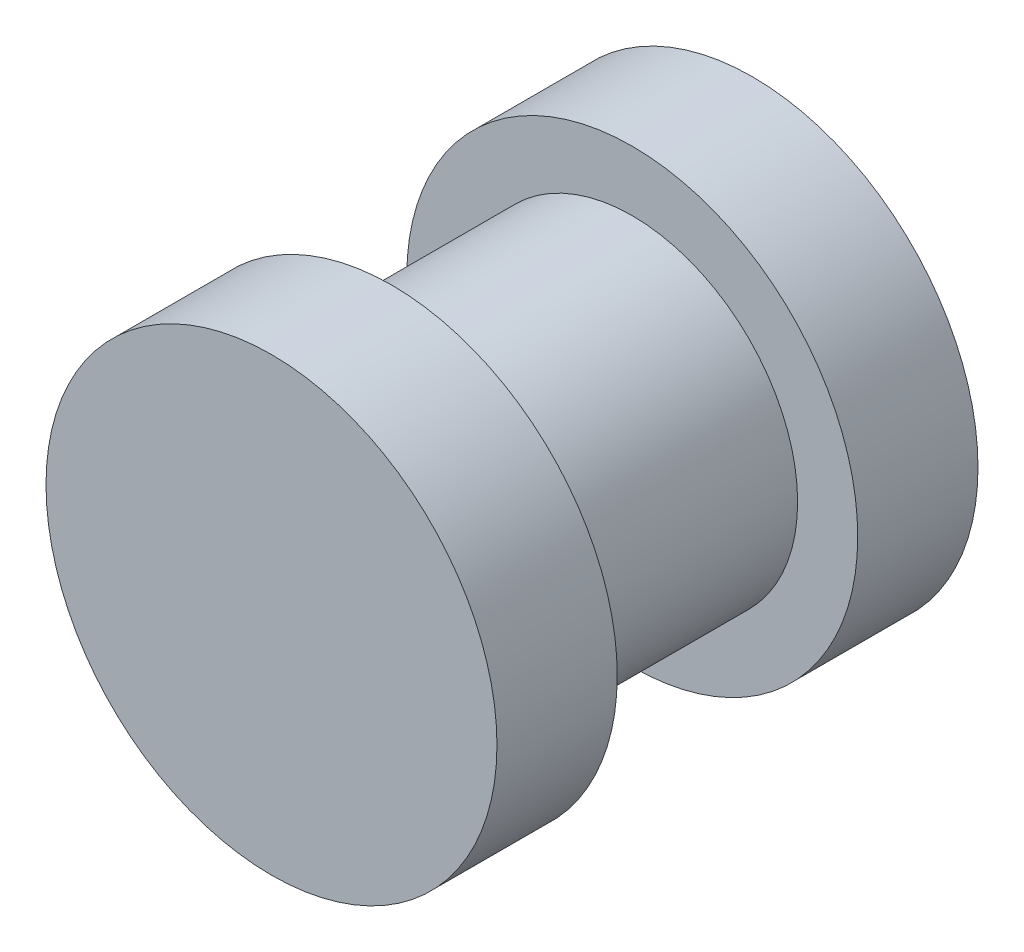
ISO-10303-21;
HEADER;
FILE_DESCRIPTION(('STEP AP214'),'2;1');
FILE_NAME('part.step','',(''),(''),'','','');
FILE_SCHEMA(('AUTOMOTIVE_DESIGN { 1 0 10303 214 1 1 1 1 }'));
ENDSEC;
DATA;
#1=APPLICATION_CONTEXT('core data for automotive mechanical design processes');
#2=APPLICATION_PROTOCOL_DEFINITION('international standard','automotive_design',2000,#1);
#3=PRODUCT_CONTEXT('',#1,'mechanical');
#4=PRODUCT('Part','Part','',(#3));
#5=PRODUCT_RELATED_PRODUCT_CATEGORY('part','',(#4));
#6=PRODUCT_DEFINITION_FORMATION('','',#4);
#7=PRODUCT_DEFINITION_CONTEXT('part definition',#1,'design');
#8=PRODUCT_DEFINITION('design','',#6,#7);
#9=PRODUCT_DEFINITION_SHAPE('','',#8);
#10=(LENGTH_UNIT() NAMED_UNIT(*) SI_UNIT(.MILLI.,.METRE.));
#11=(NAMED_UNIT(*) PLANE_ANGLE_UNIT() SI_UNIT($,.RADIAN.));
#12=(NAMED_UNIT(*) SI_UNIT($,.STERADIAN.) SOLID_ANGLE_UNIT());
#13=UNCERTAINTY_MEASURE_WITH_UNIT(LENGTH_MEASURE(1.E-05),#10,'distance_accuracy_value','');
#14=(GEOMETRIC_REPRESENTATION_CONTEXT(3) GLOBAL_UNCERTAINTY_ASSIGNED_CONTEXT((#13)) GLOBAL_UNIT_ASSIGNED_CONTEXT((#10,
#11,#12)) REPRESENTATION_CONTEXT('',''));
#15=CARTESIAN_POINT('',(0.,0.,0.));
#16=DIRECTION('',(0.,0.,1.));
#17=DIRECTION('',(1.,0.,0.));
#18=AXIS2_PLACEMENT_3D('',#15,#16,#17);
#19=CARTESIAN_POINT('',(0.,0.,5.08));
#20=DIRECTION('',(0.,0.,-1.));
#21=DIRECTION('',(-1.,0.,0.));
#22=AXIS2_PLACEMENT_3D('',#19,#20,#21);
#23=CYLINDRICAL_SURFACE('',#22,4.7625);
#24=CARTESIAN_POINT('',(0.,0.,-5.08));
#25=DIRECTION('',(0.,0.,1.));
#26=DIRECTION('',(1.,0.,0.));
#27=AXIS2_PLACEMENT_3D('',#24,#25,#26);
#28=CIRCLE('',#27,4.7625);
#29=CARTESIAN_POINT('',(4.7625,0.,-5.08));
#30=VERTEX_POINT('',#29);
#31=EDGE_CURVE('E41',#30,#30,#28,.T.);
#32=ORIENTED_EDGE('',*,*,#31,.T.);
#33=EDGE_LOOP('',(#32));
#34=FACE_BOUND('',#33,.T.);
#35=CARTESIAN_POINT('',(0.,0.,-2.54));
#36=DIRECTION('',(0.,0.,1.));
#37=DIRECTION('',(1.,0.,0.));
#38=AXIS2_PLACEMENT_3D('',#35,#36,#37);
#39=CIRCLE('',#38,4.7625);
#40=CARTESIAN_POINT('',(4.7625,0.,-2.54));
#41=VERTEX_POINT('',#40);
#42=EDGE_CURVE('E36',#41,#41,#39,.T.);
#43=ORIENTED_EDGE('',*,*,#42,.F.);
#44=EDGE_LOOP('',(#43));
#45=FACE_BOUND('',#44,.T.);
#46=ADVANCED_FACE('F33',(#34,#45),#23,.T.);
#47=CARTESIAN_POINT('',(0.,0.,-5.08));
#48=DIRECTION('',(0.,0.,1.));
#49=DIRECTION('',(1.,0.,0.));
#50=AXIS2_PLACEMENT_3D('',#47,#48,#49);
#51=PLANE('',#50);
#52=DIRECTION('',(1.,0.,0.));
#53=VECTOR('',#52,1.);
#54=CARTESIAN_POINT('',(1.905,2.54,-5.08));
#55=LINE('',#54,#53);
#56=CARTESIAN_POINT('',(-1.905,2.54,-5.08));
#57=VERTEX_POINT('',#56);
#58=CARTESIAN_POINT('',(1.905,2.54,-5.08));
#59=VERTEX_POINT('',#58);
#60=EDGE_CURVE('E84',#57,#59,#55,.T.);
#61=ORIENTED_EDGE('',*,*,#60,.F.);
#62=DIRECTION('',(0.,1.,0.));
#63=VECTOR('',#62,1.);
#64=CARTESIAN_POINT('',(-1.905,-2.54,-5.08));
#65=LINE('',#64,#63);
#66=CARTESIAN_POINT('',(-1.905,-2.54,-5.08));
#67=VERTEX_POINT('',#66);
#68=EDGE_CURVE('E49',#67,#57,#65,.T.);
#69=ORIENTED_EDGE('',*,*,#68,.F.);
#70=DIRECTION('',(-1.,0.,0.));
#71=VECTOR('',#70,1.);
#72=CARTESIAN_POINT('',(1.905,-2.54,-5.08));
#73=LINE('',#72,#71);
#74=CARTESIAN_POINT('',(1.905,-2.54,-5.08));
#75=VERTEX_POINT('',#74);
#76=EDGE_CURVE('E100',#75,#67,#73,.T.);
#77=ORIENTED_EDGE('',*,*,#76,.F.);
#78=DIRECTION('',(0.,-1.,0.));
#79=VECTOR('',#78,1.);
#80=CARTESIAN_POINT('',(1.905,-2.54,-5.08));
#81=LINE('',#80,#79);
#82=EDGE_CURVE('E107',#59,#75,#81,.T.);
#83=ORIENTED_EDGE('',*,*,#82,.F.);
#84=EDGE_LOOP('',(#61,#69,#77,#83));
#85=FACE_BOUND('',#84,.T.);
#86=ORIENTED_EDGE('',*,*,#31,.F.);
#87=EDGE_LOOP('',(#86));
#88=FACE_BOUND('',#87,.T.);
#89=ADVANCED_FACE('F139',(#85,#88),#51,.F.);
#90=CARTESIAN_POINT('',(-1.905,-2.54,-1.27));
#91=DIRECTION('',(-1.,0.,0.));
#92=DIRECTION('',(0.,0.,1.));
#93=AXIS2_PLACEMENT_3D('',#90,#91,#92);
#94=PLANE('',#93);
#95=ORIENTED_EDGE('',*,*,#68,.T.);
#96=DIRECTION('',(0.,0.,-1.));
#97=VECTOR('',#96,1.);
#98=CARTESIAN_POINT('',(-1.905,2.54,-1.27));
#99=LINE('',#98,#97);
#100=CARTESIAN_POINT('',(-1.905,2.54,-1.27));
#101=VERTEX_POINT('',#100);
#102=EDGE_CURVE('E72',#101,#57,#99,.T.);
#103=ORIENTED_EDGE('',*,*,#102,.F.);
#104=DIRECTION('',(0.,1.,0.));
#105=VECTOR('',#104,1.);
#106=CARTESIAN_POINT('',(-1.905,-2.54,-1.27));
#107=LINE('',#106,#105);
#108=CARTESIAN_POINT('',(-1.905,-2.54,-1.27));
#109=VERTEX_POINT('',#108);
#110=EDGE_CURVE('E98',#109,#101,#107,.T.);
#111=ORIENTED_EDGE('',*,*,#110,.F.);
#112=DIRECTION('',(0.,0.,-1.));
#113=VECTOR('',#112,1.);
#114=CARTESIAN_POINT('',(-1.905,-2.54,-1.27));
#115=LINE('',#114,#113);
#116=EDGE_CURVE('E57',#109,#67,#115,.T.);
#117=ORIENTED_EDGE('',*,*,#116,.T.);
#118=EDGE_LOOP('',(#95,#103,#111,#117));
#119=FACE_BOUND('',#118,.T.);
#120=ADVANCED_FACE('F145',(#119),#94,.F.);
#121=CARTESIAN_POINT('',(1.905,-2.54,-1.27));
#122=DIRECTION('',(0.,-1.,0.));
#123=DIRECTION('',(0.,0.,-1.));
#124=AXIS2_PLACEMENT_3D('',#121,#122,#123);
#125=PLANE('',#124);
#126=ORIENTED_EDGE('',*,*,#76,.T.);
#127=ORIENTED_EDGE('',*,*,#116,.F.);
#128=DIRECTION('',(-1.,0.,0.));
#129=VECTOR('',#128,1.);
#130=CARTESIAN_POINT('',(1.905,-2.54,-1.27));
#131=LINE('',#130,#129);
#132=CARTESIAN_POINT('',(1.905,-2.54,-1.27));
#133=VERTEX_POINT('',#132);
#134=EDGE_CURVE('E95',#133,#109,#131,.T.);
#135=ORIENTED_EDGE('',*,*,#134,.F.);
#136=DIRECTION('',(0.,0.,-1.));
#137=VECTOR('',#136,1.);
#138=CARTESIAN_POINT('',(1.905,-2.54,-1.27));
#139=LINE('',#138,#137);
#140=EDGE_CURVE('E88',#133,#75,#139,.T.);
#141=ORIENTED_EDGE('',*,*,#140,.T.);
#142=EDGE_LOOP('',(#126,#127,#135,#141));
#143=FACE_BOUND('',#142,.T.);
#144=ADVANCED_FACE('F164',(#143),#125,.F.);
#145=CARTESIAN_POINT('',(1.905,-2.54,-1.27));
#146=DIRECTION('',(1.,0.,0.));
#147=DIRECTION('',(0.,0.,-1.));
#148=AXIS2_PLACEMENT_3D('',#145,#146,#147);
#149=PLANE('',#148);
#150=ORIENTED_EDGE('',*,*,#82,.T.);
#151=ORIENTED_EDGE('',*,*,#140,.F.);
#152=DIRECTION('',(0.,-1.,0.));
#153=VECTOR('',#152,1.);
#154=CARTESIAN_POINT('',(1.905,-2.54,-1.27));
#155=LINE('',#154,#153);
#156=CARTESIAN_POINT('',(1.905,2.54,-1.27));
#157=VERTEX_POINT('',#156);
#158=EDGE_CURVE('E91',#157,#133,#155,.T.);
#159=ORIENTED_EDGE('',*,*,#158,.F.);
#160=DIRECTION('',(0.,0.,-1.));
#161=VECTOR('',#160,1.);
#162=CARTESIAN_POINT('',(1.905,2.54,-1.27));
#163=LINE('',#162,#161);
#164=EDGE_CURVE('E77',#157,#59,#163,.T.);
#165=ORIENTED_EDGE('',*,*,#164,.T.);
#166=EDGE_LOOP('',(#150,#151,#159,#165));
#167=FACE_BOUND('',#166,.T.);
#168=ADVANCED_FACE('F92',(#167),#149,.F.);
#169=CARTESIAN_POINT('',(1.905,2.54,-1.27));
#170=DIRECTION('',(0.,1.,0.));
#171=DIRECTION('',(0.,0.,1.));
#172=AXIS2_PLACEMENT_3D('',#169,#170,#171);
#173=PLANE('',#172);
#174=ORIENTED_EDGE('',*,*,#60,.T.);
#175=ORIENTED_EDGE('',*,*,#164,.F.);
#176=DIRECTION('',(1.,0.,0.));
#177=VECTOR('',#176,1.);
#178=CARTESIAN_POINT('',(1.905,2.54,-1.27));
#179=LINE('',#178,#177);
#180=EDGE_CURVE('E81',#101,#157,#179,.T.);
#181=ORIENTED_EDGE('',*,*,#180,.F.);
#182=ORIENTED_EDGE('',*,*,#102,.T.);
#183=EDGE_LOOP('',(#174,#175,#181,#182));
#184=FACE_BOUND('',#183,.T.);
#185=ADVANCED_FACE('F79',(#184),#173,.F.);
#186=CARTESIAN_POINT('',(0.,0.,-1.27));
#187=DIRECTION('',(0.,0.,1.));
#188=DIRECTION('',(1.,0.,0.));
#189=AXIS2_PLACEMENT_3D('',#186,#187,#188);
#190=PLANE('',#189);
#191=ORIENTED_EDGE('',*,*,#110,.T.);
#192=ORIENTED_EDGE('',*,*,#180,.T.);
#193=ORIENTED_EDGE('',*,*,#158,.T.);
#194=ORIENTED_EDGE('',*,*,#134,.T.);
#195=EDGE_LOOP('',(#191,#192,#193,#194));
#196=FACE_BOUND('',#195,.T.);
#197=ADVANCED_FACE('F97',(#196),#190,.F.);
#198=CARTESIAN_POINT('',(0.,6.0325,-2.54));
#199=DIRECTION('',(0.,0.,1.));
#200=DIRECTION('',(1.,0.,0.));
#201=AXIS2_PLACEMENT_3D('',#198,#199,#200);
#202=PLANE('',#201);
#203=CARTESIAN_POINT('',(0.,0.,-2.54));
#204=DIRECTION('',(0.,0.,1.));
#205=DIRECTION('',(1.,0.,0.));
#206=AXIS2_PLACEMENT_3D('',#203,#204,#205);
#207=CIRCLE('',#206,3.4925);
#208=CARTESIAN_POINT('',(3.4925,0.,-2.54));
#209=VERTEX_POINT('',#208);
#210=EDGE_CURVE('E121',#209,#209,#207,.T.);
#211=ORIENTED_EDGE('',*,*,#210,.F.);
#212=EDGE_LOOP('',(#211));
#213=FACE_BOUND('',#212,.T.);
#214=ORIENTED_EDGE('',*,*,#42,.T.);
#215=EDGE_LOOP('',(#214));
#216=FACE_BOUND('',#215,.T.);
#217=ADVANCED_FACE('F131',(#213,#216),#202,.T.);
#218=CARTESIAN_POINT('',(0.,6.0325,2.54));
#219=DIRECTION('',(0.,0.,-1.));
#220=DIRECTION('',(-1.,0.,0.));
#221=AXIS2_PLACEMENT_3D('',#218,#219,#220);
#222=PLANE('',#221);
#223=CARTESIAN_POINT('',(0.,0.,2.54));
#224=DIRECTION('',(0.,0.,1.));
#225=DIRECTION('',(1.,0.,0.));
#226=AXIS2_PLACEMENT_3D('',#223,#224,#225);
#227=CIRCLE('',#226,3.4925);
#228=CARTESIAN_POINT('',(3.4925,0.,2.54));
#229=VERTEX_POINT('',#228);
#230=EDGE_CURVE('E116',#229,#229,#227,.T.);
#231=ORIENTED_EDGE('',*,*,#230,.T.);
#232=EDGE_LOOP('',(#231));
#233=FACE_BOUND('',#232,.T.);
#234=CARTESIAN_POINT('',(0.,0.,2.54));
#235=DIRECTION('',(0.,0.,-1.));
#236=DIRECTION('',(-1.,0.,0.));
#237=AXIS2_PLACEMENT_3D('',#234,#235,#236);
#238=CIRCLE('',#237,4.7625);
#239=CARTESIAN_POINT('',(-4.7625,0.,2.54));
#240=VERTEX_POINT('',#239);
#241=EDGE_CURVE('E114',#240,#240,#238,.T.);
#242=ORIENTED_EDGE('',*,*,#241,.T.);
#243=EDGE_LOOP('',(#242));
#244=FACE_BOUND('',#243,.T.);
#245=ADVANCED_FACE('F134',(#233,#244),#222,.T.);
#246=CARTESIAN_POINT('',(0.,0.,0.));
#247=DIRECTION('',(0.,0.,1.));
#248=DIRECTION('',(1.,0.,0.));
#249=AXIS2_PLACEMENT_3D('',#246,#247,#248);
#250=CYLINDRICAL_SURFACE('',#249,3.4925);
#251=ORIENTED_EDGE('',*,*,#210,.T.);
#252=EDGE_LOOP('',(#251));
#253=FACE_BOUND('',#252,.T.);
#254=ORIENTED_EDGE('',*,*,#230,.F.);
#255=EDGE_LOOP('',(#254));
#256=FACE_BOUND('',#255,.T.);
#257=ADVANCED_FACE('F128',(#253,#256),#250,.T.);
#258=CARTESIAN_POINT('',(0.,0.,5.08));
#259=DIRECTION('',(0.,0.,1.));
#260=DIRECTION('',(1.,0.,0.));
#261=AXIS2_PLACEMENT_3D('',#258,#259,#260);
#262=PLANE('',#261);
#263=CARTESIAN_POINT('',(0.,0.,5.08));
#264=DIRECTION('',(0.,0.,1.));
#265=DIRECTION('',(1.,0.,0.));
#266=AXIS2_PLACEMENT_3D('',#263,#264,#265);
#267=CIRCLE('',#266,4.7625);
#268=CARTESIAN_POINT('',(4.7625,0.,5.08));
#269=VERTEX_POINT('',#268);
#270=EDGE_CURVE('E11',#269,#269,#267,.T.);
#271=ORIENTED_EDGE('',*,*,#270,.T.);
#272=EDGE_LOOP('',(#271));
#273=FACE_BOUND('',#272,.T.);
#274=ADVANCED_FACE('F148',(#273),#262,.T.);
#275=ORIENTED_EDGE('',*,*,#270,.F.);
#276=EDGE_LOOP('',(#275));
#277=FACE_BOUND('',#276,.T.);
#278=ORIENTED_EDGE('',*,*,#241,.F.);
#279=EDGE_LOOP('',(#278));
#280=FACE_BOUND('',#279,.T.);
#281=ADVANCED_FACE('F141',(#277,#280),#23,.T.);
#282=CLOSED_SHELL('',(#46,#89,#120,#144,#168,#185,#197,#217,#245,#257,#274,#281));
#283=MANIFOLD_SOLID_BREP('B2',#282);
#284=ADVANCED_BREP_SHAPE_REPRESENTATION('',(#18,#283),#14);
#285=SHAPE_DEFINITION_REPRESENTATION(#9,#284);
ENDSEC;
END-ISO-10303-21;
